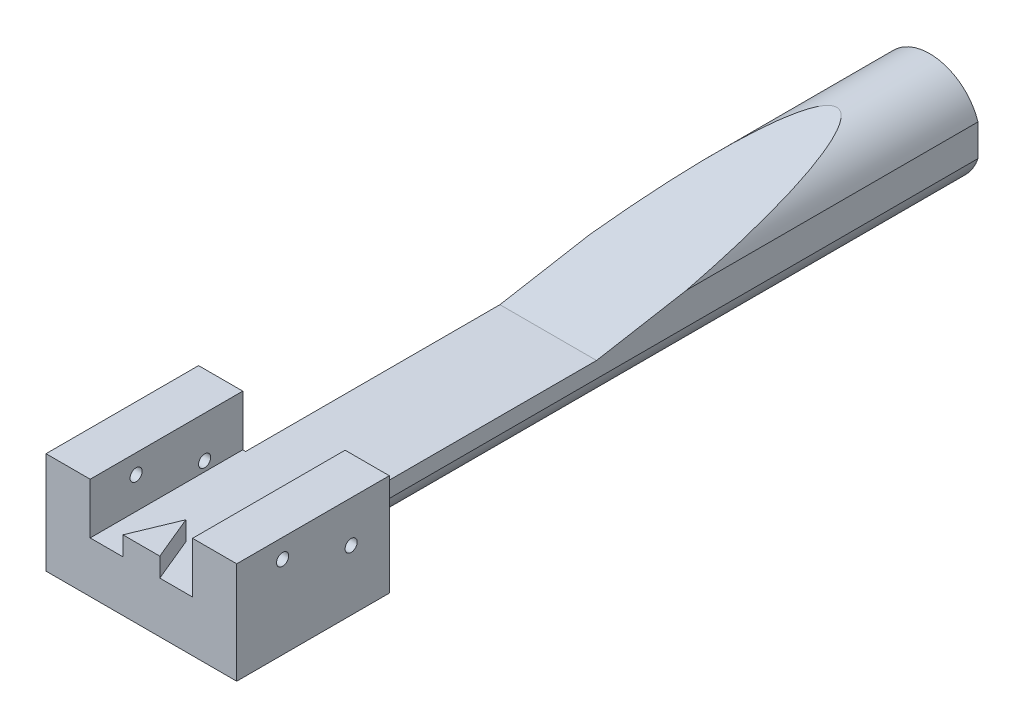
ISO-10303-21;
HEADER;
FILE_DESCRIPTION(('STEP AP214'),'2;1');
FILE_NAME('part.step','',(''),(''),'','','');
FILE_SCHEMA(('AUTOMOTIVE_DESIGN { 1 0 10303 214 1 1 1 1 }'));
ENDSEC;
DATA;
#1=APPLICATION_CONTEXT('core data for automotive mechanical design processes');
#2=APPLICATION_PROTOCOL_DEFINITION('international standard','automotive_design',2000,#1);
#3=PRODUCT_CONTEXT('',#1,'mechanical');
#4=PRODUCT('Part','Part','',(#3));
#5=PRODUCT_RELATED_PRODUCT_CATEGORY('part','',(#4));
#6=PRODUCT_DEFINITION_FORMATION('','',#4);
#7=PRODUCT_DEFINITION_CONTEXT('part definition',#1,'design');
#8=PRODUCT_DEFINITION('design','',#6,#7);
#9=PRODUCT_DEFINITION_SHAPE('','',#8);
#10=(LENGTH_UNIT() NAMED_UNIT(*) SI_UNIT(.MILLI.,.METRE.));
#11=(NAMED_UNIT(*) PLANE_ANGLE_UNIT() SI_UNIT($,.RADIAN.));
#12=(NAMED_UNIT(*) SI_UNIT($,.STERADIAN.) SOLID_ANGLE_UNIT());
#13=UNCERTAINTY_MEASURE_WITH_UNIT(LENGTH_MEASURE(1.E-05),#10,'distance_accuracy_value','');
#14=(GEOMETRIC_REPRESENTATION_CONTEXT(3) GLOBAL_UNCERTAINTY_ASSIGNED_CONTEXT((#13)) GLOBAL_UNIT_ASSIGNED_CONTEXT((#10,
#11,#12)) REPRESENTATION_CONTEXT('',''));
#15=CARTESIAN_POINT('',(0.,0.,0.));
#16=DIRECTION('',(0.,0.,1.));
#17=DIRECTION('',(1.,0.,0.));
#18=AXIS2_PLACEMENT_3D('',#15,#16,#17);
#19=CARTESIAN_POINT('',(0.,0.,50.));
#20=DIRECTION('',(0.,0.,-1.));
#21=DIRECTION('',(-1.,0.,0.));
#22=AXIS2_PLACEMENT_3D('',#19,#20,#21);
#23=CYLINDRICAL_SURFACE('',#22,4.);
#24=CARTESIAN_POINT('',(0.,0.,50.));
#25=DIRECTION('',(0.,0.,1.));
#26=DIRECTION('',(1.,0.,0.));
#27=AXIS2_PLACEMENT_3D('',#24,#25,#26);
#28=CIRCLE('',#27,4.);
#29=CARTESIAN_POINT('',(-3.8,-1.24899959967969,50.));
#30=VERTEX_POINT('',#29);
#31=CARTESIAN_POINT('',(0.,-4.,50.));
#32=VERTEX_POINT('',#31);
#33=EDGE_CURVE('E178',#30,#32,#28,.T.);
#34=ORIENTED_EDGE('',*,*,#33,.F.);
#35=DIRECTION('',(0.,0.,-1.));
#36=VECTOR('',#35,1.);
#37=CARTESIAN_POINT('',(-3.8,-1.24899959967969,50.));
#38=LINE('',#37,#36);
#39=CARTESIAN_POINT('',(-3.8,-1.24899959967969,0.));
#40=VERTEX_POINT('',#39);
#41=EDGE_CURVE('E405',#30,#40,#38,.T.);
#42=ORIENTED_EDGE('',*,*,#41,.T.);
#43=CARTESIAN_POINT('',(0.,0.,0.));
#44=DIRECTION('',(0.,0.,1.));
#45=DIRECTION('',(1.,0.,0.));
#46=AXIS2_PLACEMENT_3D('',#43,#44,#45);
#47=CIRCLE('',#46,4.);
#48=CARTESIAN_POINT('',(3.8,-1.24899959967969,0.));
#49=VERTEX_POINT('',#48);
#50=EDGE_CURVE('E172',#40,#49,#47,.T.);
#51=ORIENTED_EDGE('',*,*,#50,.T.);
#52=DIRECTION('',(0.,0.,-1.));
#53=VECTOR('',#52,1.);
#54=CARTESIAN_POINT('',(3.8,-1.24899959967969,50.));
#55=LINE('',#54,#53);
#56=CARTESIAN_POINT('',(3.8,-1.24899959967969,50.));
#57=VERTEX_POINT('',#56);
#58=EDGE_CURVE('E203',#49,#57,#55,.F.);
#59=ORIENTED_EDGE('',*,*,#58,.T.);
#60=EDGE_CURVE('E175',#32,#57,#28,.T.);
#61=ORIENTED_EDGE('',*,*,#60,.F.);
#62=EDGE_LOOP('',(#34,#42,#51,#59,#61));
#63=FACE_BOUND('',#62,.T.);
#64=ADVANCED_FACE('F34',(#63),#23,.T.);
#65=CARTESIAN_POINT('',(0.,0.,0.));
#66=DIRECTION('',(0.,1.,0.));
#67=DIRECTION('',(-1.,0.,0.));
#68=AXIS2_PLACEMENT_3D('',#65,#66,#67);
#69=PLANE('',#68);
#70=DIRECTION('',(0.,0.,-1.));
#71=VECTOR('',#70,1.);
#72=CARTESIAN_POINT('',(-3.8,0.,0.));
#73=LINE('',#72,#71);
#74=CARTESIAN_POINT('',(-3.8,0.,50.));
#75=VERTEX_POINT('',#74);
#76=CARTESIAN_POINT('',(-3.8,0.,30.));
#77=VERTEX_POINT('',#76);
#78=EDGE_CURVE('E49',#75,#77,#73,.T.);
#79=ORIENTED_EDGE('',*,*,#78,.F.);
#80=DIRECTION('',(-1.,0.,0.));
#81=VECTOR('',#80,1.);
#82=CARTESIAN_POINT('',(0.,0.,50.));
#83=LINE('',#82,#81);
#84=CARTESIAN_POINT('',(-4.02499999999999,0.,50.));
#85=VERTEX_POINT('',#84);
#86=EDGE_CURVE('E269',#75,#85,#83,.T.);
#87=ORIENTED_EDGE('',*,*,#86,.T.);
#88=DIRECTION('',(0.,0.,1.));
#89=VECTOR('',#88,1.);
#90=CARTESIAN_POINT('',(-4.02499999999999,0.,30.));
#91=LINE('',#90,#89);
#92=CARTESIAN_POINT('',(-4.02499999999999,0.,62.));
#93=VERTEX_POINT('',#92);
#94=EDGE_CURVE('E255',#85,#93,#91,.T.);
#95=ORIENTED_EDGE('',*,*,#94,.T.);
#96=DIRECTION('',(1.,0.,0.));
#97=VECTOR('',#96,1.);
#98=CARTESIAN_POINT('',(-4.02499999999999,0.,62.));
#99=LINE('',#98,#97);
#100=CARTESIAN_POINT('',(-1.44974746830582,0.,62.));
#101=VERTEX_POINT('',#100);
#102=EDGE_CURVE('E286',#93,#101,#99,.T.);
#103=ORIENTED_EDGE('',*,*,#102,.T.);
#104=DIRECTION('',(-0.382683432365087,0.,0.923879532511288));
#105=VECTOR('',#104,1.);
#106=CARTESIAN_POINT('',(-1.44974746830582,0.,62.));
#107=LINE('',#106,#105);
#108=CARTESIAN_POINT('',(0.,0.,58.5));
#109=VERTEX_POINT('',#108);
#110=EDGE_CURVE('E354',#109,#101,#107,.T.);
#111=ORIENTED_EDGE('',*,*,#110,.F.);
#112=DIRECTION('',(-0.382683432365088,0.,-0.923879532511288));
#113=VECTOR('',#112,1.);
#114=CARTESIAN_POINT('',(0.,0.,58.5));
#115=LINE('',#114,#113);
#116=CARTESIAN_POINT('',(1.44974746830582,0.,62.));
#117=VERTEX_POINT('',#116);
#118=EDGE_CURVE('E353',#117,#109,#115,.T.);
#119=ORIENTED_EDGE('',*,*,#118,.F.);
#120=CARTESIAN_POINT('',(4.02499999999999,0.,62.));
#121=VERTEX_POINT('',#120);
#122=EDGE_CURVE('E293',#117,#121,#99,.T.);
#123=ORIENTED_EDGE('',*,*,#122,.T.);
#124=DIRECTION('',(0.,0.,-1.));
#125=VECTOR('',#124,1.);
#126=CARTESIAN_POINT('',(4.02499999999999,0.,30.));
#127=LINE('',#126,#125);
#128=CARTESIAN_POINT('',(4.02499999999999,0.,50.));
#129=VERTEX_POINT('',#128);
#130=EDGE_CURVE('E297',#121,#129,#127,.T.);
#131=ORIENTED_EDGE('',*,*,#130,.T.);
#132=DIRECTION('',(-1.,0.,0.));
#133=VECTOR('',#132,1.);
#134=CARTESIAN_POINT('',(0.,0.,50.));
#135=LINE('',#134,#133);
#136=CARTESIAN_POINT('',(3.8,0.,50.));
#137=VERTEX_POINT('',#136);
#138=EDGE_CURVE('E265',#129,#137,#135,.T.);
#139=ORIENTED_EDGE('',*,*,#138,.T.);
#140=DIRECTION('',(0.,0.,1.));
#141=VECTOR('',#140,1.);
#142=CARTESIAN_POINT('',(3.8,0.,0.));
#143=LINE('',#142,#141);
#144=CARTESIAN_POINT('',(3.8,0.,30.));
#145=VERTEX_POINT('',#144);
#146=EDGE_CURVE('E304',#145,#137,#143,.T.);
#147=ORIENTED_EDGE('',*,*,#146,.F.);
#148=DIRECTION('',(-1.,0.,0.));
#149=VECTOR('',#148,1.);
#150=CARTESIAN_POINT('',(-4.02499999999999,0.,30.));
#151=LINE('',#150,#149);
#152=EDGE_CURVE('E260',#145,#77,#151,.T.);
#153=ORIENTED_EDGE('',*,*,#152,.T.);
#154=EDGE_LOOP('',(#79,#87,#95,#103,#111,#119,#123,#131,#139,#147,#153));
#155=FACE_BOUND('',#154,.T.);
#156=ADVANCED_FACE('F291',(#155),#69,.T.);
#157=CARTESIAN_POINT('',(3.8,1.24899959967969,0.));
#158=VERTEX_POINT('',#157);
#159=CARTESIAN_POINT('',(-3.8,1.24899959967969,0.));
#160=VERTEX_POINT('',#159);
#161=EDGE_CURVE('E171',#158,#160,#47,.T.);
#162=ORIENTED_EDGE('',*,*,#161,.T.);
#163=DIRECTION('',(0.,0.,-1.));
#164=VECTOR('',#163,1.);
#165=CARTESIAN_POINT('',(-3.8,1.24899959967969,50.));
#166=LINE('',#165,#164);
#167=CARTESIAN_POINT('',(-3.8,1.24899959967968,22.9165712776268));
#168=VERTEX_POINT('',#167);
#169=EDGE_CURVE('E158',#160,#168,#166,.F.);
#170=ORIENTED_EDGE('',*,*,#169,.T.);
#171=CARTESIAN_POINT('',(0.,0.,30.));
#172=DIRECTION('',(0.,-0.984807753012208,-0.17364817766693));
#173=DIRECTION('',(0.,0.17364817766693,-0.984807753012208));
#174=AXIS2_PLACEMENT_3D('',#171,#172,#173);
#175=ELLIPSE('',#174,23.0350819325745,4.);
#176=CARTESIAN_POINT('',(3.8,1.24899959967969,22.9165712776268));
#177=VERTEX_POINT('',#176);
#178=EDGE_CURVE('E56',#168,#177,#175,.T.);
#179=ORIENTED_EDGE('',*,*,#178,.T.);
#180=DIRECTION('',(0.,0.,-1.));
#181=VECTOR('',#180,1.);
#182=CARTESIAN_POINT('',(3.8,1.24899959967969,50.));
#183=LINE('',#182,#181);
#184=EDGE_CURVE('E174',#177,#158,#183,.T.);
#185=ORIENTED_EDGE('',*,*,#184,.T.);
#186=EDGE_LOOP('',(#162,#170,#179,#185));
#187=FACE_BOUND('',#186,.T.);
#188=ADVANCED_FACE('F36',(#187),#23,.T.);
#189=CARTESIAN_POINT('',(-7.5,4.,62.));
#190=DIRECTION('',(0.,-1.,0.));
#191=DIRECTION('',(1.,0.,0.));
#192=AXIS2_PLACEMENT_3D('',#189,#190,#191);
#193=PLANE('',#192);
#194=DIRECTION('',(-1.,0.,0.));
#195=VECTOR('',#194,1.);
#196=CARTESIAN_POINT('',(-7.5,4.,62.));
#197=LINE('',#196,#195);
#198=CARTESIAN_POINT('',(-4.02499999999999,4.,62.));
#199=VERTEX_POINT('',#198);
#200=CARTESIAN_POINT('',(-7.5,4.,62.));
#201=VERTEX_POINT('',#200);
#202=EDGE_CURVE('E250',#199,#201,#197,.T.);
#203=ORIENTED_EDGE('',*,*,#202,.F.);
#204=DIRECTION('',(0.,0.,1.));
#205=VECTOR('',#204,1.);
#206=CARTESIAN_POINT('',(-4.025,4.,30.));
#207=LINE('',#206,#205);
#208=CARTESIAN_POINT('',(-4.02499999999999,4.,50.));
#209=VERTEX_POINT('',#208);
#210=EDGE_CURVE('E249',#209,#199,#207,.T.);
#211=ORIENTED_EDGE('',*,*,#210,.F.);
#212=DIRECTION('',(-1.,0.,0.));
#213=VECTOR('',#212,1.);
#214=CARTESIAN_POINT('',(-7.5,4.,50.));
#215=LINE('',#214,#213);
#216=CARTESIAN_POINT('',(-7.5,4.,50.));
#217=VERTEX_POINT('',#216);
#218=EDGE_CURVE('E222',#209,#217,#215,.T.);
#219=ORIENTED_EDGE('',*,*,#218,.T.);
#220=DIRECTION('',(0.,0.,-1.));
#221=VECTOR('',#220,1.);
#222=CARTESIAN_POINT('',(-7.5,4.,62.));
#223=LINE('',#222,#221);
#224=EDGE_CURVE('E227',#201,#217,#223,.T.);
#225=ORIENTED_EDGE('',*,*,#224,.F.);
#226=EDGE_LOOP('',(#203,#211,#219,#225));
#227=FACE_BOUND('',#226,.T.);
#228=ADVANCED_FACE('F248',(#227),#193,.F.);
#229=CARTESIAN_POINT('',(0.,0.,0.));
#230=DIRECTION('',(0.,0.,1.));
#231=DIRECTION('',(1.,0.,0.));
#232=AXIS2_PLACEMENT_3D('',#229,#230,#231);
#233=PLANE('',#232);
#234=CARTESIAN_POINT('',(0.,0.,0.));
#235=DIRECTION('',(0.,0.,-1.));
#236=DIRECTION('',(-1.,0.,0.));
#237=AXIS2_PLACEMENT_3D('',#234,#235,#236);
#238=CIRCLE('',#237,1.65);
#239=CARTESIAN_POINT('',(-1.65,0.,0.));
#240=VERTEX_POINT('',#239);
#241=EDGE_CURVE('E396',#240,#240,#238,.T.);
#242=ORIENTED_EDGE('',*,*,#241,.F.);
#243=EDGE_LOOP('',(#242));
#244=FACE_BOUND('',#243,.T.);
#245=ORIENTED_EDGE('',*,*,#50,.F.);
#246=DIRECTION('',(0.,-1.,0.));
#247=VECTOR('',#246,1.);
#248=CARTESIAN_POINT('',(-3.8,4.,0.));
#249=LINE('',#248,#247);
#250=EDGE_CURVE('E161',#160,#40,#249,.T.);
#251=ORIENTED_EDGE('',*,*,#250,.F.);
#252=ORIENTED_EDGE('',*,*,#161,.F.);
#253=DIRECTION('',(0.,1.,0.));
#254=VECTOR('',#253,1.);
#255=CARTESIAN_POINT('',(3.8,4.,0.));
#256=LINE('',#255,#254);
#257=EDGE_CURVE('E403',#49,#158,#256,.T.);
#258=ORIENTED_EDGE('',*,*,#257,.F.);
#259=EDGE_LOOP('',(#245,#251,#252,#258));
#260=FACE_BOUND('',#259,.T.);
#261=ADVANCED_FACE('F169',(#244,#260),#233,.F.);
#262=CARTESIAN_POINT('',(0.,0.,50.));
#263=DIRECTION('',(0.,0.,1.));
#264=DIRECTION('',(1.,0.,0.));
#265=AXIS2_PLACEMENT_3D('',#262,#263,#264);
#266=PLANE('',#265);
#267=ORIENTED_EDGE('',*,*,#33,.T.);
#268=DIRECTION('',(1.,0.,0.));
#269=VECTOR('',#268,1.);
#270=CARTESIAN_POINT('',(-7.5,-4.,50.));
#271=LINE('',#270,#269);
#272=CARTESIAN_POINT('',(-7.5,-4.,50.));
#273=VERTEX_POINT('',#272);
#274=EDGE_CURVE('E197',#273,#32,#271,.T.);
#275=ORIENTED_EDGE('',*,*,#274,.F.);
#276=DIRECTION('',(0.,-1.,0.));
#277=VECTOR('',#276,1.);
#278=CARTESIAN_POINT('',(-7.5,4.,50.));
#279=LINE('',#278,#277);
#280=EDGE_CURVE('E214',#217,#273,#279,.T.);
#281=ORIENTED_EDGE('',*,*,#280,.F.);
#282=ORIENTED_EDGE('',*,*,#218,.F.);
#283=DIRECTION('',(0.,-1.,0.));
#284=VECTOR('',#283,1.);
#285=CARTESIAN_POINT('',(-4.02499999999999,0.,50.));
#286=LINE('',#285,#284);
#287=EDGE_CURVE('E217',#209,#85,#286,.T.);
#288=ORIENTED_EDGE('',*,*,#287,.T.);
#289=ORIENTED_EDGE('',*,*,#86,.F.);
#290=DIRECTION('',(0.,-1.,0.));
#291=VECTOR('',#290,1.);
#292=CARTESIAN_POINT('',(-3.8,4.,50.));
#293=LINE('',#292,#291);
#294=EDGE_CURVE('E164',#75,#30,#293,.T.);
#295=ORIENTED_EDGE('',*,*,#294,.T.);
#296=EDGE_LOOP('',(#267,#275,#281,#282,#288,#289,#295));
#297=FACE_BOUND('',#296,.T.);
#298=ADVANCED_FACE('F195',(#297),#266,.F.);
#299=ORIENTED_EDGE('',*,*,#60,.T.);
#300=DIRECTION('',(0.,1.,0.));
#301=VECTOR('',#300,1.);
#302=CARTESIAN_POINT('',(3.8,4.,50.));
#303=LINE('',#302,#301);
#304=EDGE_CURVE('E402',#57,#137,#303,.T.);
#305=ORIENTED_EDGE('',*,*,#304,.T.);
#306=ORIENTED_EDGE('',*,*,#138,.F.);
#307=DIRECTION('',(0.,1.,0.));
#308=VECTOR('',#307,1.);
#309=CARTESIAN_POINT('',(4.02499999999999,0.,50.));
#310=LINE('',#309,#308);
#311=CARTESIAN_POINT('',(4.02499999999999,4.,50.));
#312=VERTEX_POINT('',#311);
#313=EDGE_CURVE('E271',#129,#312,#310,.T.);
#314=ORIENTED_EDGE('',*,*,#313,.T.);
#315=CARTESIAN_POINT('',(7.5,4.,50.));
#316=VERTEX_POINT('',#315);
#317=EDGE_CURVE('E223',#316,#312,#215,.T.);
#318=ORIENTED_EDGE('',*,*,#317,.F.);
#319=DIRECTION('',(0.,1.,0.));
#320=VECTOR('',#319,1.);
#321=CARTESIAN_POINT('',(7.5,4.,50.));
#322=LINE('',#321,#320);
#323=CARTESIAN_POINT('',(7.5,-4.,50.));
#324=VERTEX_POINT('',#323);
#325=EDGE_CURVE('E210',#324,#316,#322,.T.);
#326=ORIENTED_EDGE('',*,*,#325,.F.);
#327=EDGE_CURVE('E207',#32,#324,#271,.T.);
#328=ORIENTED_EDGE('',*,*,#327,.F.);
#329=EDGE_LOOP('',(#299,#305,#306,#314,#318,#326,#328));
#330=FACE_BOUND('',#329,.T.);
#331=ADVANCED_FACE('F208',(#330),#266,.F.);
#332=CARTESIAN_POINT('',(-7.5,4.,62.));
#333=DIRECTION('',(1.,0.,0.));
#334=DIRECTION('',(0.,0.,-1.));
#335=AXIS2_PLACEMENT_3D('',#332,#333,#334);
#336=PLANE('',#335);
#337=CARTESIAN_POINT('',(-7.5,0.749999999999997,53.));
#338=DIRECTION('',(-1.,0.,0.));
#339=DIRECTION('',(0.,0.,1.));
#340=AXIS2_PLACEMENT_3D('',#337,#338,#339);
#341=CIRCLE('',#340,0.474999999999998);
#342=CARTESIAN_POINT('',(-7.5,0.749999999999997,53.475));
#343=VERTEX_POINT('',#342);
#344=EDGE_CURVE('E390',#343,#343,#341,.T.);
#345=ORIENTED_EDGE('',*,*,#344,.F.);
#346=EDGE_LOOP('',(#345));
#347=FACE_BOUND('',#346,.T.);
#348=CARTESIAN_POINT('',(-7.5,2.5,58.3904373688234));
#349=DIRECTION('',(-1.,0.,0.));
#350=DIRECTION('',(0.,0.,1.));
#351=AXIS2_PLACEMENT_3D('',#348,#349,#350);
#352=CIRCLE('',#351,0.474999999999998);
#353=CARTESIAN_POINT('',(-7.5,2.5,58.8654373688234));
#354=VERTEX_POINT('',#353);
#355=EDGE_CURVE('E383',#354,#354,#352,.T.);
#356=ORIENTED_EDGE('',*,*,#355,.F.);
#357=EDGE_LOOP('',(#356));
#358=FACE_BOUND('',#357,.T.);
#359=ORIENTED_EDGE('',*,*,#280,.T.);
#360=DIRECTION('',(0.,0.,-1.));
#361=VECTOR('',#360,1.);
#362=CARTESIAN_POINT('',(-7.5,-4.,62.));
#363=LINE('',#362,#361);
#364=CARTESIAN_POINT('',(-7.5,-4.,62.));
#365=VERTEX_POINT('',#364);
#366=EDGE_CURVE('E180',#365,#273,#363,.T.);
#367=ORIENTED_EDGE('',*,*,#366,.F.);
#368=DIRECTION('',(0.,-1.,0.));
#369=VECTOR('',#368,1.);
#370=CARTESIAN_POINT('',(-7.5,4.,62.));
#371=LINE('',#370,#369);
#372=EDGE_CURVE('E226',#201,#365,#371,.T.);
#373=ORIENTED_EDGE('',*,*,#372,.F.);
#374=ORIENTED_EDGE('',*,*,#224,.T.);
#375=EDGE_LOOP('',(#359,#367,#373,#374));
#376=FACE_BOUND('',#375,.T.);
#377=ADVANCED_FACE('F241',(#347,#358,#376),#336,.F.);
#378=CARTESIAN_POINT('',(-7.5,-4.,62.));
#379=DIRECTION('',(0.,1.,0.));
#380=DIRECTION('',(-1.,0.,0.));
#381=AXIS2_PLACEMENT_3D('',#378,#379,#380);
#382=PLANE('',#381);
#383=ORIENTED_EDGE('',*,*,#274,.T.);
#384=ORIENTED_EDGE('',*,*,#327,.T.);
#385=DIRECTION('',(0.,0.,-1.));
#386=VECTOR('',#385,1.);
#387=CARTESIAN_POINT('',(7.5,-4.,62.));
#388=LINE('',#387,#386);
#389=CARTESIAN_POINT('',(7.5,-4.,62.));
#390=VERTEX_POINT('',#389);
#391=EDGE_CURVE('E234',#390,#324,#388,.T.);
#392=ORIENTED_EDGE('',*,*,#391,.F.);
#393=DIRECTION('',(1.,0.,0.));
#394=VECTOR('',#393,1.);
#395=CARTESIAN_POINT('',(-7.5,-4.,62.));
#396=LINE('',#395,#394);
#397=EDGE_CURVE('E237',#365,#390,#396,.T.);
#398=ORIENTED_EDGE('',*,*,#397,.F.);
#399=ORIENTED_EDGE('',*,*,#366,.T.);
#400=EDGE_LOOP('',(#383,#384,#392,#398,#399));
#401=FACE_BOUND('',#400,.T.);
#402=ADVANCED_FACE('F236',(#401),#382,.F.);
#403=CARTESIAN_POINT('',(7.5,4.,62.));
#404=DIRECTION('',(-1.,0.,0.));
#405=DIRECTION('',(0.,-1.,0.));
#406=AXIS2_PLACEMENT_3D('',#403,#404,#405);
#407=PLANE('',#406);
#408=CARTESIAN_POINT('',(7.5,0.749999999999997,53.));
#409=DIRECTION('',(-1.,0.,0.));
#410=DIRECTION('',(0.,0.,1.));
#411=AXIS2_PLACEMENT_3D('',#408,#409,#410);
#412=CIRCLE('',#411,0.474999999999996);
#413=CARTESIAN_POINT('',(7.5,0.749999999999997,53.475));
#414=VERTEX_POINT('',#413);
#415=EDGE_CURVE('E186',#414,#414,#412,.T.);
#416=ORIENTED_EDGE('',*,*,#415,.T.);
#417=EDGE_LOOP('',(#416));
#418=FACE_BOUND('',#417,.T.);
#419=CARTESIAN_POINT('',(7.5,2.5,58.3904373688234));
#420=DIRECTION('',(-1.,0.,0.));
#421=DIRECTION('',(0.,0.,1.));
#422=AXIS2_PLACEMENT_3D('',#419,#420,#421);
#423=CIRCLE('',#422,0.474999999999996);
#424=CARTESIAN_POINT('',(7.5,2.5,58.8654373688234));
#425=VERTEX_POINT('',#424);
#426=EDGE_CURVE('E380',#425,#425,#423,.T.);
#427=ORIENTED_EDGE('',*,*,#426,.T.);
#428=EDGE_LOOP('',(#427));
#429=FACE_BOUND('',#428,.T.);
#430=ORIENTED_EDGE('',*,*,#325,.T.);
#431=DIRECTION('',(0.,0.,-1.));
#432=VECTOR('',#431,1.);
#433=CARTESIAN_POINT('',(7.5,4.,62.));
#434=LINE('',#433,#432);
#435=CARTESIAN_POINT('',(7.5,4.,62.));
#436=VERTEX_POINT('',#435);
#437=EDGE_CURVE('E230',#436,#316,#434,.T.);
#438=ORIENTED_EDGE('',*,*,#437,.F.);
#439=DIRECTION('',(0.,1.,0.));
#440=VECTOR('',#439,1.);
#441=CARTESIAN_POINT('',(7.5,4.,62.));
#442=LINE('',#441,#440);
#443=EDGE_CURVE('E277',#390,#436,#442,.T.);
#444=ORIENTED_EDGE('',*,*,#443,.F.);
#445=ORIENTED_EDGE('',*,*,#391,.T.);
#446=EDGE_LOOP('',(#430,#438,#444,#445));
#447=FACE_BOUND('',#446,.T.);
#448=ADVANCED_FACE('F337',(#418,#429,#447),#407,.F.);
#449=ORIENTED_EDGE('',*,*,#317,.T.);
#450=DIRECTION('',(0.,0.,-1.));
#451=VECTOR('',#450,1.);
#452=CARTESIAN_POINT('',(4.02499999999999,4.,30.));
#453=LINE('',#452,#451);
#454=CARTESIAN_POINT('',(4.02499999999999,4.,62.));
#455=VERTEX_POINT('',#454);
#456=EDGE_CURVE('E253',#455,#312,#453,.T.);
#457=ORIENTED_EDGE('',*,*,#456,.F.);
#458=EDGE_CURVE('E231',#436,#455,#197,.T.);
#459=ORIENTED_EDGE('',*,*,#458,.F.);
#460=ORIENTED_EDGE('',*,*,#437,.T.);
#461=EDGE_LOOP('',(#449,#457,#459,#460));
#462=FACE_BOUND('',#461,.T.);
#463=ADVANCED_FACE('F329',(#462),#193,.F.);
#464=CARTESIAN_POINT('',(0.,0.,62.));
#465=DIRECTION('',(0.,0.,1.));
#466=DIRECTION('',(1.,0.,0.));
#467=AXIS2_PLACEMENT_3D('',#464,#465,#466);
#468=PLANE('',#467);
#469=DIRECTION('',(0.,1.,0.));
#470=VECTOR('',#469,1.);
#471=CARTESIAN_POINT('',(-4.02499999999999,0.,62.));
#472=LINE('',#471,#470);
#473=EDGE_CURVE('E266',#93,#199,#472,.T.);
#474=ORIENTED_EDGE('',*,*,#473,.T.);
#475=ORIENTED_EDGE('',*,*,#202,.T.);
#476=ORIENTED_EDGE('',*,*,#372,.T.);
#477=ORIENTED_EDGE('',*,*,#397,.T.);
#478=ORIENTED_EDGE('',*,*,#443,.T.);
#479=ORIENTED_EDGE('',*,*,#458,.T.);
#480=DIRECTION('',(0.,1.,0.));
#481=VECTOR('',#480,1.);
#482=CARTESIAN_POINT('',(4.02499999999999,0.,62.));
#483=LINE('',#482,#481);
#484=EDGE_CURVE('E263',#121,#455,#483,.T.);
#485=ORIENTED_EDGE('',*,*,#484,.F.);
#486=ORIENTED_EDGE('',*,*,#122,.F.);
#487=DIRECTION('',(0.,-1.,0.));
#488=VECTOR('',#487,1.);
#489=CARTESIAN_POINT('',(1.44974746830582,1.5,62.));
#490=LINE('',#489,#488);
#491=CARTESIAN_POINT('',(1.44974746830582,1.5,62.));
#492=VERTEX_POINT('',#491);
#493=EDGE_CURVE('E257',#492,#117,#490,.T.);
#494=ORIENTED_EDGE('',*,*,#493,.F.);
#495=DIRECTION('',(1.,0.,0.));
#496=VECTOR('',#495,1.);
#497=CARTESIAN_POINT('',(1.44974746830582,1.5,62.));
#498=LINE('',#497,#496);
#499=CARTESIAN_POINT('',(-1.44974746830582,1.5,62.));
#500=VERTEX_POINT('',#499);
#501=EDGE_CURVE('E358',#500,#492,#498,.T.);
#502=ORIENTED_EDGE('',*,*,#501,.F.);
#503=DIRECTION('',(0.,-1.,0.));
#504=VECTOR('',#503,1.);
#505=CARTESIAN_POINT('',(-1.44974746830582,1.5,62.));
#506=LINE('',#505,#504);
#507=EDGE_CURVE('E367',#500,#101,#506,.T.);
#508=ORIENTED_EDGE('',*,*,#507,.T.);
#509=ORIENTED_EDGE('',*,*,#102,.F.);
#510=EDGE_LOOP('',(#474,#475,#476,#477,#478,#479,#485,#486,#494,#502,#508,#509));
#511=FACE_BOUND('',#510,.T.);
#512=ADVANCED_FACE('F282',(#511),#468,.T.);
#513=CARTESIAN_POINT('',(-4.02499999999999,0.,30.));
#514=DIRECTION('',(-1.,0.,0.));
#515=DIRECTION('',(0.,-1.,0.));
#516=AXIS2_PLACEMENT_3D('',#513,#514,#515);
#517=PLANE('',#516);
#518=CARTESIAN_POINT('',(-4.02499999999999,0.749999999999997,53.));
#519=DIRECTION('',(-1.,0.,0.));
#520=DIRECTION('',(0.,-1.,0.));
#521=AXIS2_PLACEMENT_3D('',#518,#519,#520);
#522=CIRCLE('',#521,0.474999999999997);
#523=CARTESIAN_POINT('',(-4.02499999999999,0.275,53.));
#524=VERTEX_POINT('',#523);
#525=EDGE_CURVE('E185',#524,#524,#522,.T.);
#526=ORIENTED_EDGE('',*,*,#525,.T.);
#527=EDGE_LOOP('',(#526));
#528=FACE_BOUND('',#527,.T.);
#529=CARTESIAN_POINT('',(-4.02499999999999,2.5,58.3904373688234));
#530=DIRECTION('',(-1.,0.,0.));
#531=DIRECTION('',(0.,-1.,0.));
#532=AXIS2_PLACEMENT_3D('',#529,#530,#531);
#533=CIRCLE('',#532,0.474999999999997);
#534=CARTESIAN_POINT('',(-4.02499999999999,2.025,58.3904373688234));
#535=VERTEX_POINT('',#534);
#536=EDGE_CURVE('E361',#535,#535,#533,.T.);
#537=ORIENTED_EDGE('',*,*,#536,.T.);
#538=EDGE_LOOP('',(#537));
#539=FACE_BOUND('',#538,.T.);
#540=ORIENTED_EDGE('',*,*,#210,.T.);
#541=ORIENTED_EDGE('',*,*,#473,.F.);
#542=ORIENTED_EDGE('',*,*,#94,.F.);
#543=ORIENTED_EDGE('',*,*,#287,.F.);
#544=EDGE_LOOP('',(#540,#541,#542,#543));
#545=FACE_BOUND('',#544,.T.);
#546=ADVANCED_FACE('F289',(#528,#539,#545),#517,.F.);
#547=CARTESIAN_POINT('',(4.02499999999999,0.,30.));
#548=DIRECTION('',(1.,0.,0.));
#549=DIRECTION('',(0.,1.,0.));
#550=AXIS2_PLACEMENT_3D('',#547,#548,#549);
#551=PLANE('',#550);
#552=CARTESIAN_POINT('',(4.02499999999999,0.749999999999997,53.));
#553=DIRECTION('',(1.,0.,0.));
#554=DIRECTION('',(0.,1.,0.));
#555=AXIS2_PLACEMENT_3D('',#552,#553,#554);
#556=CIRCLE('',#555,0.474999999999997);
#557=CARTESIAN_POINT('',(4.02499999999999,1.22499999999999,53.));
#558=VERTEX_POINT('',#557);
#559=EDGE_CURVE('E183',#558,#558,#556,.T.);
#560=ORIENTED_EDGE('',*,*,#559,.T.);
#561=EDGE_LOOP('',(#560));
#562=FACE_BOUND('',#561,.T.);
#563=CARTESIAN_POINT('',(4.02499999999999,2.5,58.3904373688234));
#564=DIRECTION('',(1.,0.,0.));
#565=DIRECTION('',(0.,1.,0.));
#566=AXIS2_PLACEMENT_3D('',#563,#564,#565);
#567=CIRCLE('',#566,0.474999999999997);
#568=CARTESIAN_POINT('',(4.02499999999999,2.97499999999999,58.3904373688234));
#569=VERTEX_POINT('',#568);
#570=EDGE_CURVE('E356',#569,#569,#567,.T.);
#571=ORIENTED_EDGE('',*,*,#570,.T.);
#572=EDGE_LOOP('',(#571));
#573=FACE_BOUND('',#572,.T.);
#574=ORIENTED_EDGE('',*,*,#130,.F.);
#575=ORIENTED_EDGE('',*,*,#484,.T.);
#576=ORIENTED_EDGE('',*,*,#456,.T.);
#577=ORIENTED_EDGE('',*,*,#313,.F.);
#578=EDGE_LOOP('',(#574,#575,#576,#577));
#579=FACE_BOUND('',#578,.T.);
#580=ADVANCED_FACE('F308',(#562,#573,#579),#551,.F.);
#581=CARTESIAN_POINT('',(-10.,0.,30.));
#582=DIRECTION('',(0.,-0.984807753012208,-0.17364817766693));
#583=DIRECTION('',(0.,0.17364817766693,-0.984807753012208));
#584=AXIS2_PLACEMENT_3D('',#581,#582,#583);
#585=PLANE('',#584);
#586=ORIENTED_EDGE('',*,*,#178,.F.);
#587=DIRECTION('',(0.,-0.17364817766693,0.984807753012208));
#588=VECTOR('',#587,1.);
#589=CARTESIAN_POINT('',(-3.8,0.,30.));
#590=LINE('',#589,#588);
#591=EDGE_CURVE('E11',#168,#77,#590,.T.);
#592=ORIENTED_EDGE('',*,*,#591,.T.);
#593=ORIENTED_EDGE('',*,*,#152,.F.);
#594=DIRECTION('',(0.,0.17364817766693,-0.984807753012208));
#595=VECTOR('',#594,1.);
#596=CARTESIAN_POINT('',(3.8,0.,30.));
#597=LINE('',#596,#595);
#598=EDGE_CURVE('E42',#145,#177,#597,.T.);
#599=ORIENTED_EDGE('',*,*,#598,.T.);
#600=EDGE_LOOP('',(#586,#592,#593,#599));
#601=FACE_BOUND('',#600,.T.);
#602=ADVANCED_FACE('F305',(#601),#585,.F.);
#603=CARTESIAN_POINT('',(0.,1.5,58.5));
#604=DIRECTION('',(-0.923879532511288,0.,0.382683432365087));
#605=DIRECTION('',(0.382683432365088,0.,0.923879532511288));
#606=AXIS2_PLACEMENT_3D('',#603,#604,#605);
#607=PLANE('',#606);
#608=ORIENTED_EDGE('',*,*,#118,.T.);
#609=DIRECTION('',(0.,-1.,0.));
#610=VECTOR('',#609,1.);
#611=CARTESIAN_POINT('',(0.,1.5,58.5));
#612=LINE('',#611,#610);
#613=CARTESIAN_POINT('',(0.,1.5,58.5));
#614=VERTEX_POINT('',#613);
#615=EDGE_CURVE('E369',#614,#109,#612,.T.);
#616=ORIENTED_EDGE('',*,*,#615,.F.);
#617=DIRECTION('',(-0.382683432365088,0.,-0.923879532511288));
#618=VECTOR('',#617,1.);
#619=CARTESIAN_POINT('',(0.,1.5,58.5));
#620=LINE('',#619,#618);
#621=EDGE_CURVE('E370',#492,#614,#620,.T.);
#622=ORIENTED_EDGE('',*,*,#621,.F.);
#623=ORIENTED_EDGE('',*,*,#493,.T.);
#624=EDGE_LOOP('',(#608,#616,#622,#623));
#625=FACE_BOUND('',#624,.T.);
#626=ADVANCED_FACE('F307',(#625),#607,.F.);
#627=CARTESIAN_POINT('',(-1.44974746830582,1.5,62.));
#628=DIRECTION('',(0.923879532511288,0.,0.382683432365087));
#629=DIRECTION('',(0.382683432365087,0.,-0.923879532511288));
#630=AXIS2_PLACEMENT_3D('',#627,#628,#629);
#631=PLANE('',#630);
#632=ORIENTED_EDGE('',*,*,#110,.T.);
#633=ORIENTED_EDGE('',*,*,#507,.F.);
#634=DIRECTION('',(-0.382683432365087,0.,0.923879532511288));
#635=VECTOR('',#634,1.);
#636=CARTESIAN_POINT('',(-1.44974746830582,1.5,62.));
#637=LINE('',#636,#635);
#638=EDGE_CURVE('E364',#614,#500,#637,.T.);
#639=ORIENTED_EDGE('',*,*,#638,.F.);
#640=ORIENTED_EDGE('',*,*,#615,.T.);
#641=EDGE_LOOP('',(#632,#633,#639,#640));
#642=FACE_BOUND('',#641,.T.);
#643=ADVANCED_FACE('F314',(#642),#631,.F.);
#644=CARTESIAN_POINT('',(0.,1.5,0.));
#645=DIRECTION('',(0.,-1.,0.));
#646=DIRECTION('',(1.,0.,0.));
#647=AXIS2_PLACEMENT_3D('',#644,#645,#646);
#648=PLANE('',#647);
#649=ORIENTED_EDGE('',*,*,#501,.T.);
#650=ORIENTED_EDGE('',*,*,#621,.T.);
#651=ORIENTED_EDGE('',*,*,#638,.T.);
#652=EDGE_LOOP('',(#649,#650,#651));
#653=FACE_BOUND('',#652,.T.);
#654=ADVANCED_FACE('F374',(#653),#648,.F.);
#655=CARTESIAN_POINT('',(-7.5,2.5,58.3904373688234));
#656=DIRECTION('',(-1.,0.,0.));
#657=DIRECTION('',(0.,0.,1.));
#658=AXIS2_PLACEMENT_3D('',#655,#656,#657);
#659=CYLINDRICAL_SURFACE('',#658,0.474999999999997);
#660=ORIENTED_EDGE('',*,*,#426,.F.);
#661=EDGE_LOOP('',(#660));
#662=FACE_BOUND('',#661,.T.);
#663=ORIENTED_EDGE('',*,*,#570,.F.);
#664=EDGE_LOOP('',(#663));
#665=FACE_BOUND('',#664,.T.);
#666=ADVANCED_FACE('F431',(#662,#665),#659,.F.);
#667=ORIENTED_EDGE('',*,*,#355,.T.);
#668=EDGE_LOOP('',(#667));
#669=FACE_BOUND('',#668,.T.);
#670=ORIENTED_EDGE('',*,*,#536,.F.);
#671=EDGE_LOOP('',(#670));
#672=FACE_BOUND('',#671,.T.);
#673=ADVANCED_FACE('F434',(#669,#672),#659,.F.);
#674=CARTESIAN_POINT('',(-7.5,0.749999999999997,53.));
#675=DIRECTION('',(-1.,0.,0.));
#676=DIRECTION('',(0.,0.,1.));
#677=AXIS2_PLACEMENT_3D('',#674,#675,#676);
#678=CYLINDRICAL_SURFACE('',#677,0.474999999999997);
#679=ORIENTED_EDGE('',*,*,#415,.F.);
#680=EDGE_LOOP('',(#679));
#681=FACE_BOUND('',#680,.T.);
#682=ORIENTED_EDGE('',*,*,#559,.F.);
#683=EDGE_LOOP('',(#682));
#684=FACE_BOUND('',#683,.T.);
#685=ADVANCED_FACE('F429',(#681,#684),#678,.F.);
#686=ORIENTED_EDGE('',*,*,#344,.T.);
#687=EDGE_LOOP('',(#686));
#688=FACE_BOUND('',#687,.T.);
#689=ORIENTED_EDGE('',*,*,#525,.F.);
#690=EDGE_LOOP('',(#689));
#691=FACE_BOUND('',#690,.T.);
#692=ADVANCED_FACE('F425',(#688,#691),#678,.F.);
#693=CARTESIAN_POINT('',(0.,0.,15.));
#694=DIRECTION('',(0.,0.,-1.));
#695=DIRECTION('',(-1.,0.,0.));
#696=AXIS2_PLACEMENT_3D('',#693,#694,#695);
#697=CONICAL_SURFACE('',#696,1.65,1.02974425867665);
#698=CARTESIAN_POINT('',(0.,0.,15.9914200213955));
#699=VERTEX_POINT('',#698);
#700=VERTEX_LOOP('',#699);
#701=FACE_BOUND('',#700,.T.);
#702=CARTESIAN_POINT('',(0.,0.,15.));
#703=DIRECTION('',(0.,0.,-1.));
#704=DIRECTION('',(-1.,0.,0.));
#705=AXIS2_PLACEMENT_3D('',#702,#703,#704);
#706=CIRCLE('',#705,1.65);
#707=CARTESIAN_POINT('',(-1.65,0.,15.));
#708=VERTEX_POINT('',#707);
#709=EDGE_CURVE('E393',#708,#708,#706,.T.);
#710=ORIENTED_EDGE('',*,*,#709,.T.);
#711=EDGE_LOOP('',(#710));
#712=FACE_BOUND('',#711,.T.);
#713=ADVANCED_FACE('F419',(#701,#712),#697,.F.);
#714=CARTESIAN_POINT('',(0.,0.,0.));
#715=DIRECTION('',(0.,0.,-1.));
#716=DIRECTION('',(-1.,0.,0.));
#717=AXIS2_PLACEMENT_3D('',#714,#715,#716);
#718=CYLINDRICAL_SURFACE('',#717,1.65);
#719=ORIENTED_EDGE('',*,*,#709,.F.);
#720=EDGE_LOOP('',(#719));
#721=FACE_BOUND('',#720,.T.);
#722=ORIENTED_EDGE('',*,*,#241,.T.);
#723=EDGE_LOOP('',(#722));
#724=FACE_BOUND('',#723,.T.);
#725=ADVANCED_FACE('F412',(#721,#724),#718,.F.);
#726=CARTESIAN_POINT('',(3.8,4.,50.));
#727=DIRECTION('',(-1.,0.,0.));
#728=DIRECTION('',(0.,-1.,0.));
#729=AXIS2_PLACEMENT_3D('',#726,#727,#728);
#730=PLANE('',#729);
#731=ORIENTED_EDGE('',*,*,#257,.T.);
#732=ORIENTED_EDGE('',*,*,#184,.F.);
#733=ORIENTED_EDGE('',*,*,#598,.F.);
#734=ORIENTED_EDGE('',*,*,#146,.T.);
#735=ORIENTED_EDGE('',*,*,#304,.F.);
#736=ORIENTED_EDGE('',*,*,#58,.F.);
#737=EDGE_LOOP('',(#731,#732,#733,#734,#735,#736));
#738=FACE_BOUND('',#737,.T.);
#739=ADVANCED_FACE('F410',(#738),#730,.F.);
#740=CARTESIAN_POINT('',(-3.8,4.,50.));
#741=DIRECTION('',(1.,0.,0.));
#742=DIRECTION('',(0.,1.,0.));
#743=AXIS2_PLACEMENT_3D('',#740,#741,#742);
#744=PLANE('',#743);
#745=ORIENTED_EDGE('',*,*,#294,.F.);
#746=ORIENTED_EDGE('',*,*,#78,.T.);
#747=ORIENTED_EDGE('',*,*,#591,.F.);
#748=ORIENTED_EDGE('',*,*,#169,.F.);
#749=ORIENTED_EDGE('',*,*,#250,.T.);
#750=ORIENTED_EDGE('',*,*,#41,.F.);
#751=EDGE_LOOP('',(#745,#746,#747,#748,#749,#750));
#752=FACE_BOUND('',#751,.T.);
#753=ADVANCED_FACE('F160',(#752),#744,.F.);
#754=CLOSED_SHELL('',(#64,#156,#188,#228,#261,#298,#331,#377,#402,#448,#463,#512,#546,#580,#602,
#626,#643,#654,#666,#673,#685,#692,#713,#725,#739,#753));
#755=MANIFOLD_SOLID_BREP('B2',#754);
#756=ADVANCED_BREP_SHAPE_REPRESENTATION('',(#18,#755),#14);
#757=SHAPE_DEFINITION_REPRESENTATION(#9,#756);
ENDSEC;
END-ISO-10303-21;
